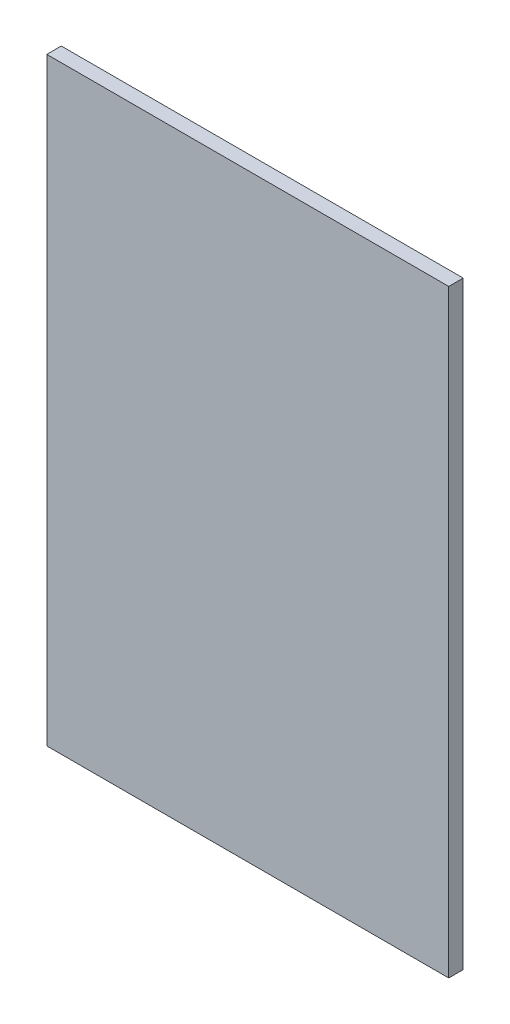
ISO-10303-21;
HEADER;
FILE_DESCRIPTION(('STEP AP214'),'2;1');
FILE_NAME('part.step','',(''),(''),'','','');
FILE_SCHEMA(('AUTOMOTIVE_DESIGN { 1 0 10303 214 1 1 1 1 }'));
ENDSEC;
DATA;
#1=APPLICATION_CONTEXT('core data for automotive mechanical design processes');
#2=APPLICATION_PROTOCOL_DEFINITION('international standard','automotive_design',2000,#1);
#3=PRODUCT_CONTEXT('',#1,'mechanical');
#4=PRODUCT('Part','Part','',(#3));
#5=PRODUCT_RELATED_PRODUCT_CATEGORY('part','',(#4));
#6=PRODUCT_DEFINITION_FORMATION('','',#4);
#7=PRODUCT_DEFINITION_CONTEXT('part definition',#1,'design');
#8=PRODUCT_DEFINITION('design','',#6,#7);
#9=PRODUCT_DEFINITION_SHAPE('','',#8);
#10=(LENGTH_UNIT() NAMED_UNIT(*) SI_UNIT(.MILLI.,.METRE.));
#11=(NAMED_UNIT(*) PLANE_ANGLE_UNIT() SI_UNIT($,.RADIAN.));
#12=(NAMED_UNIT(*) SI_UNIT($,.STERADIAN.) SOLID_ANGLE_UNIT());
#13=UNCERTAINTY_MEASURE_WITH_UNIT(LENGTH_MEASURE(1.E-05),#10,'distance_accuracy_value','');
#14=(GEOMETRIC_REPRESENTATION_CONTEXT(3) GLOBAL_UNCERTAINTY_ASSIGNED_CONTEXT((#13)) GLOBAL_UNIT_ASSIGNED_CONTEXT((#10,
#11,#12)) REPRESENTATION_CONTEXT('',''));
#15=CARTESIAN_POINT('',(0.,0.,0.));
#16=DIRECTION('',(0.,0.,1.));
#17=DIRECTION('',(1.,0.,0.));
#18=AXIS2_PLACEMENT_3D('',#15,#16,#17);
#19=CARTESIAN_POINT('',(-250.,-372.5,18.));
#20=DIRECTION('',(1.,0.,0.));
#21=DIRECTION('',(0.,0.,-1.));
#22=AXIS2_PLACEMENT_3D('',#19,#20,#21);
#23=PLANE('',#22);
#24=DIRECTION('',(0.,-1.,0.));
#25=VECTOR('',#24,1.);
#26=CARTESIAN_POINT('',(-250.,-372.5,0.));
#27=LINE('',#26,#25);
#28=CARTESIAN_POINT('',(-250.,372.5,0.));
#29=VERTEX_POINT('',#28);
#30=CARTESIAN_POINT('',(-250.,-372.5,0.));
#31=VERTEX_POINT('',#30);
#32=EDGE_CURVE('E95',#29,#31,#27,.T.);
#33=ORIENTED_EDGE('',*,*,#32,.T.);
#34=DIRECTION('',(0.,0.,-1.));
#35=VECTOR('',#34,1.);
#36=CARTESIAN_POINT('',(-250.,-372.5,18.));
#37=LINE('',#36,#35);
#38=CARTESIAN_POINT('',(-250.,-372.5,18.));
#39=VERTEX_POINT('',#38);
#40=EDGE_CURVE('E11',#39,#31,#37,.T.);
#41=ORIENTED_EDGE('',*,*,#40,.F.);
#42=DIRECTION('',(0.,-1.,0.));
#43=VECTOR('',#42,1.);
#44=CARTESIAN_POINT('',(-250.,-372.5,18.));
#45=LINE('',#44,#43);
#46=CARTESIAN_POINT('',(-250.,372.5,18.));
#47=VERTEX_POINT('',#46);
#48=EDGE_CURVE('E83',#47,#39,#45,.T.);
#49=ORIENTED_EDGE('',*,*,#48,.F.);
#50=DIRECTION('',(0.,0.,-1.));
#51=VECTOR('',#50,1.);
#52=CARTESIAN_POINT('',(-250.,372.5,18.));
#53=LINE('',#52,#51);
#54=EDGE_CURVE('E91',#47,#29,#53,.T.);
#55=ORIENTED_EDGE('',*,*,#54,.T.);
#56=EDGE_LOOP('',(#33,#41,#49,#55));
#57=FACE_BOUND('',#56,.T.);
#58=ADVANCED_FACE('F32',(#57),#23,.F.);
#59=CARTESIAN_POINT('',(250.,-372.5,18.));
#60=DIRECTION('',(0.,1.,0.));
#61=DIRECTION('',(-1.,0.,0.));
#62=AXIS2_PLACEMENT_3D('',#59,#60,#61);
#63=PLANE('',#62);
#64=DIRECTION('',(1.,0.,0.));
#65=VECTOR('',#64,1.);
#66=CARTESIAN_POINT('',(250.,-372.5,0.));
#67=LINE('',#66,#65);
#68=CARTESIAN_POINT('',(250.,-372.5,0.));
#69=VERTEX_POINT('',#68);
#70=EDGE_CURVE('E87',#31,#69,#67,.T.);
#71=ORIENTED_EDGE('',*,*,#70,.T.);
#72=DIRECTION('',(0.,0.,-1.));
#73=VECTOR('',#72,1.);
#74=CARTESIAN_POINT('',(250.,-372.5,18.));
#75=LINE('',#74,#73);
#76=CARTESIAN_POINT('',(250.,-372.5,18.));
#77=VERTEX_POINT('',#76);
#78=EDGE_CURVE('E40',#77,#69,#75,.T.);
#79=ORIENTED_EDGE('',*,*,#78,.F.);
#80=DIRECTION('',(1.,0.,0.));
#81=VECTOR('',#80,1.);
#82=CARTESIAN_POINT('',(250.,-372.5,18.));
#83=LINE('',#82,#81);
#84=EDGE_CURVE('E78',#39,#77,#83,.T.);
#85=ORIENTED_EDGE('',*,*,#84,.F.);
#86=ORIENTED_EDGE('',*,*,#40,.T.);
#87=EDGE_LOOP('',(#71,#79,#85,#86));
#88=FACE_BOUND('',#87,.T.);
#89=ADVANCED_FACE('F86',(#88),#63,.F.);
#90=CARTESIAN_POINT('',(250.,-372.5,18.));
#91=DIRECTION('',(-1.,0.,0.));
#92=DIRECTION('',(0.,0.,1.));
#93=AXIS2_PLACEMENT_3D('',#90,#91,#92);
#94=PLANE('',#93);
#95=DIRECTION('',(0.,1.,0.));
#96=VECTOR('',#95,1.);
#97=CARTESIAN_POINT('',(250.,-372.5,0.));
#98=LINE('',#97,#96);
#99=CARTESIAN_POINT('',(250.,372.5,0.));
#100=VERTEX_POINT('',#99);
#101=EDGE_CURVE('E65',#69,#100,#98,.T.);
#102=ORIENTED_EDGE('',*,*,#101,.T.);
#103=DIRECTION('',(0.,0.,-1.));
#104=VECTOR('',#103,1.);
#105=CARTESIAN_POINT('',(250.,372.5,18.));
#106=LINE('',#105,#104);
#107=CARTESIAN_POINT('',(250.,372.5,18.));
#108=VERTEX_POINT('',#107);
#109=EDGE_CURVE('E88',#108,#100,#106,.T.);
#110=ORIENTED_EDGE('',*,*,#109,.F.);
#111=DIRECTION('',(0.,1.,0.));
#112=VECTOR('',#111,1.);
#113=CARTESIAN_POINT('',(250.,-372.5,18.));
#114=LINE('',#113,#112);
#115=EDGE_CURVE('E81',#77,#108,#114,.T.);
#116=ORIENTED_EDGE('',*,*,#115,.F.);
#117=ORIENTED_EDGE('',*,*,#78,.T.);
#118=EDGE_LOOP('',(#102,#110,#116,#117));
#119=FACE_BOUND('',#118,.T.);
#120=ADVANCED_FACE('F89',(#119),#94,.F.);
#121=CARTESIAN_POINT('',(250.,372.5,18.));
#122=DIRECTION('',(0.,-1.,0.));
#123=DIRECTION('',(1.,0.,0.));
#124=AXIS2_PLACEMENT_3D('',#121,#122,#123);
#125=PLANE('',#124);
#126=DIRECTION('',(-1.,0.,0.));
#127=VECTOR('',#126,1.);
#128=CARTESIAN_POINT('',(250.,372.5,0.));
#129=LINE('',#128,#127);
#130=EDGE_CURVE('E71',#100,#29,#129,.T.);
#131=ORIENTED_EDGE('',*,*,#130,.T.);
#132=ORIENTED_EDGE('',*,*,#54,.F.);
#133=DIRECTION('',(-1.,0.,0.));
#134=VECTOR('',#133,1.);
#135=CARTESIAN_POINT('',(250.,372.5,18.));
#136=LINE('',#135,#134);
#137=EDGE_CURVE('E48',#108,#47,#136,.T.);
#138=ORIENTED_EDGE('',*,*,#137,.F.);
#139=ORIENTED_EDGE('',*,*,#109,.T.);
#140=EDGE_LOOP('',(#131,#132,#138,#139));
#141=FACE_BOUND('',#140,.T.);
#142=ADVANCED_FACE('F102',(#141),#125,.F.);
#143=CARTESIAN_POINT('',(0.,0.,18.));
#144=DIRECTION('',(0.,0.,1.));
#145=DIRECTION('',(1.,0.,0.));
#146=AXIS2_PLACEMENT_3D('',#143,#144,#145);
#147=PLANE('',#146);
#148=ORIENTED_EDGE('',*,*,#48,.T.);
#149=ORIENTED_EDGE('',*,*,#84,.T.);
#150=ORIENTED_EDGE('',*,*,#115,.T.);
#151=ORIENTED_EDGE('',*,*,#137,.T.);
#152=EDGE_LOOP('',(#148,#149,#150,#151));
#153=FACE_BOUND('',#152,.T.);
#154=ADVANCED_FACE('F79',(#153),#147,.T.);
#155=CARTESIAN_POINT('',(0.,0.,0.));
#156=DIRECTION('',(0.,0.,1.));
#157=DIRECTION('',(1.,0.,0.));
#158=AXIS2_PLACEMENT_3D('',#155,#156,#157);
#159=PLANE('',#158);
#160=ORIENTED_EDGE('',*,*,#32,.F.);
#161=ORIENTED_EDGE('',*,*,#130,.F.);
#162=ORIENTED_EDGE('',*,*,#101,.F.);
#163=ORIENTED_EDGE('',*,*,#70,.F.);
#164=EDGE_LOOP('',(#160,#161,#162,#163));
#165=FACE_BOUND('',#164,.T.);
#166=ADVANCED_FACE('F105',(#165),#159,.F.);
#167=CLOSED_SHELL('',(#58,#89,#120,#142,#154,#166));
#168=MANIFOLD_SOLID_BREP('B2',#167);
#169=ADVANCED_BREP_SHAPE_REPRESENTATION('',(#18,#168),#14);
#170=SHAPE_DEFINITION_REPRESENTATION(#9,#169);
ENDSEC;
END-ISO-10303-21;
